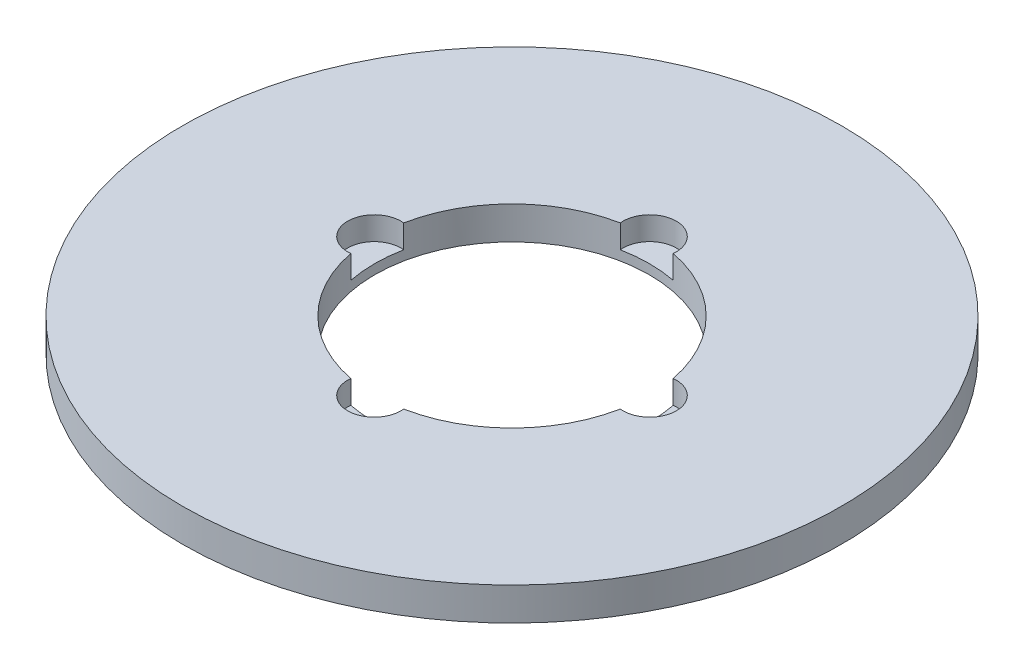
ISO-10303-21;
HEADER;
FILE_DESCRIPTION(('STEP AP214'),'2;1');
FILE_NAME('part.step','',(''),(''),'','','');
FILE_SCHEMA(('AUTOMOTIVE_DESIGN { 1 0 10303 214 1 1 1 1 }'));
ENDSEC;
DATA;
#1=APPLICATION_CONTEXT('core data for automotive mechanical design processes');
#2=APPLICATION_PROTOCOL_DEFINITION('international standard','automotive_design',2000,#1);
#3=PRODUCT_CONTEXT('',#1,'mechanical');
#4=PRODUCT('Part','Part','',(#3));
#5=PRODUCT_RELATED_PRODUCT_CATEGORY('part','',(#4));
#6=PRODUCT_DEFINITION_FORMATION('','',#4);
#7=PRODUCT_DEFINITION_CONTEXT('part definition',#1,'design');
#8=PRODUCT_DEFINITION('design','',#6,#7);
#9=PRODUCT_DEFINITION_SHAPE('','',#8);
#10=(LENGTH_UNIT() NAMED_UNIT(*) SI_UNIT(.MILLI.,.METRE.));
#11=(NAMED_UNIT(*) PLANE_ANGLE_UNIT() SI_UNIT($,.RADIAN.));
#12=(NAMED_UNIT(*) SI_UNIT($,.STERADIAN.) SOLID_ANGLE_UNIT());
#13=UNCERTAINTY_MEASURE_WITH_UNIT(LENGTH_MEASURE(1.E-05),#10,'distance_accuracy_value','');
#14=(GEOMETRIC_REPRESENTATION_CONTEXT(3) GLOBAL_UNCERTAINTY_ASSIGNED_CONTEXT((#13)) GLOBAL_UNIT_ASSIGNED_CONTEXT((#10,
#11,#12)) REPRESENTATION_CONTEXT('',''));
#15=CARTESIAN_POINT('',(0.,0.,0.));
#16=DIRECTION('',(0.,0.,1.));
#17=DIRECTION('',(1.,0.,0.));
#18=AXIS2_PLACEMENT_3D('',#15,#16,#17);
#19=CARTESIAN_POINT('',(0.,9.,0.));
#20=DIRECTION('',(0.,-1.,0.));
#21=DIRECTION('',(0.,0.,-1.));
#22=AXIS2_PLACEMENT_3D('',#19,#20,#21);
#23=CYLINDRICAL_SURFACE('',#22,90.);
#24=CARTESIAN_POINT('',(0.,9.,0.));
#25=DIRECTION('',(0.,1.,0.));
#26=DIRECTION('',(0.,0.,1.));
#27=AXIS2_PLACEMENT_3D('',#24,#25,#26);
#28=CIRCLE('',#27,90.);
#29=CARTESIAN_POINT('',(0.,9.,90.));
#30=VERTEX_POINT('',#29);
#31=EDGE_CURVE('E145',#30,#30,#28,.T.);
#32=ORIENTED_EDGE('',*,*,#31,.F.);
#33=EDGE_LOOP('',(#32));
#34=FACE_BOUND('',#33,.T.);
#35=CARTESIAN_POINT('',(0.,0.,0.));
#36=DIRECTION('',(0.,1.,0.));
#37=DIRECTION('',(0.,0.,1.));
#38=AXIS2_PLACEMENT_3D('',#35,#36,#37);
#39=CIRCLE('',#38,90.);
#40=CARTESIAN_POINT('',(0.,0.,90.));
#41=VERTEX_POINT('',#40);
#42=EDGE_CURVE('E143',#41,#41,#39,.T.);
#43=ORIENTED_EDGE('',*,*,#42,.T.);
#44=EDGE_LOOP('',(#43));
#45=FACE_BOUND('',#44,.T.);
#46=ADVANCED_FACE('F39',(#34,#45),#23,.T.);
#47=CARTESIAN_POINT('',(0.,9.,0.));
#48=DIRECTION('',(0.,1.,0.));
#49=DIRECTION('',(0.,0.,1.));
#50=AXIS2_PLACEMENT_3D('',#47,#48,#49);
#51=PLANE('',#50);
#52=CARTESIAN_POINT('',(1.3128581398508E-13,9.,37.6017515902234));
#53=DIRECTION('',(0.,1.,0.));
#54=DIRECTION('',(1.,0.,0.));
#55=AXIS2_PLACEMENT_3D('',#52,#53,#54);
#56=CIRCLE('',#55,7.27109568283892);
#57=CARTESIAN_POINT('',(-7.22643843125415,9.,36.797127436789));
#58=VERTEX_POINT('',#57);
#59=CARTESIAN_POINT('',(7.22643843125441,9.,36.797127436789));
#60=VERTEX_POINT('',#59);
#61=EDGE_CURVE('E152',#58,#60,#56,.T.);
#62=ORIENTED_EDGE('',*,*,#61,.F.);
#63=CARTESIAN_POINT('',(0.,9.,0.));
#64=DIRECTION('',(0.,1.,0.));
#65=DIRECTION('',(0.,0.,1.));
#66=AXIS2_PLACEMENT_3D('',#63,#64,#65);
#67=CIRCLE('',#66,37.5);
#68=CARTESIAN_POINT('',(-36.797127436789,9.,7.22643843125428));
#69=VERTEX_POINT('',#68);
#70=EDGE_CURVE('E133',#69,#58,#67,.T.);
#71=ORIENTED_EDGE('',*,*,#70,.F.);
#72=CARTESIAN_POINT('',(-37.6017515902234,9.,0.));
#73=DIRECTION('',(0.,1.,0.));
#74=DIRECTION('',(0.,0.,1.));
#75=AXIS2_PLACEMENT_3D('',#72,#73,#74);
#76=CIRCLE('',#75,7.27109568283892);
#77=CARTESIAN_POINT('',(-36.797127436789,9.,-7.22643843125428));
#78=VERTEX_POINT('',#77);
#79=EDGE_CURVE('E128',#78,#69,#76,.T.);
#80=ORIENTED_EDGE('',*,*,#79,.F.);
#81=CARTESIAN_POINT('',(-7.22643843125466,9.,-36.7971274367889));
#82=VERTEX_POINT('',#81);
#83=EDGE_CURVE('E121',#82,#78,#67,.T.);
#84=ORIENTED_EDGE('',*,*,#83,.F.);
#85=CARTESIAN_POINT('',(-3.93857441955241E-13,9.,-37.6017515902234));
#86=DIRECTION('',(0.,1.,0.));
#87=DIRECTION('',(-1.,0.,0.));
#88=AXIS2_PLACEMENT_3D('',#85,#86,#87);
#89=CIRCLE('',#88,7.27109568283892);
#90=CARTESIAN_POINT('',(7.22643843125389,9.,-36.7971274367891));
#91=VERTEX_POINT('',#90);
#92=EDGE_CURVE('E105',#91,#82,#89,.T.);
#93=ORIENTED_EDGE('',*,*,#92,.F.);
#94=CARTESIAN_POINT('',(36.797127436789,9.,-7.22643843125428));
#95=VERTEX_POINT('',#94);
#96=EDGE_CURVE('E131',#95,#91,#67,.T.);
#97=ORIENTED_EDGE('',*,*,#96,.F.);
#98=CARTESIAN_POINT('',(37.6017515902234,9.,0.));
#99=DIRECTION('',(0.,1.,0.));
#100=DIRECTION('',(0.,0.,-1.));
#101=AXIS2_PLACEMENT_3D('',#98,#99,#100);
#102=CIRCLE('',#101,7.27109568283892);
#103=CARTESIAN_POINT('',(36.797127436789,9.,7.22643843125428));
#104=VERTEX_POINT('',#103);
#105=EDGE_CURVE('E154',#104,#95,#102,.T.);
#106=ORIENTED_EDGE('',*,*,#105,.F.);
#107=EDGE_CURVE('E134',#60,#104,#67,.T.);
#108=ORIENTED_EDGE('',*,*,#107,.F.);
#109=EDGE_LOOP('',(#62,#71,#80,#84,#93,#97,#106,#108));
#110=FACE_BOUND('',#109,.T.);
#111=ORIENTED_EDGE('',*,*,#31,.T.);
#112=EDGE_LOOP('',(#111));
#113=FACE_BOUND('',#112,.T.);
#114=ADVANCED_FACE('F130',(#110,#113),#51,.T.);
#115=CARTESIAN_POINT('',(0.,0.,0.));
#116=DIRECTION('',(0.,1.,0.));
#117=DIRECTION('',(0.,0.,1.));
#118=AXIS2_PLACEMENT_3D('',#115,#116,#117);
#119=PLANE('',#118);
#120=CARTESIAN_POINT('',(0.,0.,0.));
#121=DIRECTION('',(0.,1.,0.));
#122=DIRECTION('',(0.,0.,1.));
#123=AXIS2_PLACEMENT_3D('',#120,#121,#122);
#124=CIRCLE('',#123,37.5);
#125=CARTESIAN_POINT('',(0.,0.,37.5));
#126=VERTEX_POINT('',#125);
#127=EDGE_CURVE('E135',#126,#126,#124,.T.);
#128=ORIENTED_EDGE('',*,*,#127,.T.);
#129=EDGE_LOOP('',(#128));
#130=FACE_BOUND('',#129,.T.);
#131=ORIENTED_EDGE('',*,*,#42,.F.);
#132=EDGE_LOOP('',(#131));
#133=FACE_BOUND('',#132,.T.);
#134=ADVANCED_FACE('F195',(#130,#133),#119,.F.);
#135=CARTESIAN_POINT('',(0.,9.,0.));
#136=DIRECTION('',(0.,-1.,0.));
#137=DIRECTION('',(0.,0.,-1.));
#138=AXIS2_PLACEMENT_3D('',#135,#136,#137);
#139=CYLINDRICAL_SURFACE('',#138,37.5);
#140=DIRECTION('',(0.,1.,0.));
#141=VECTOR('',#140,1.);
#142=CARTESIAN_POINT('',(-7.22643843125415,5.82186332209537,36.797127436789));
#143=LINE('',#142,#141);
#144=CARTESIAN_POINT('',(-7.22643843125415,2.64372664419074,36.797127436789));
#145=VERTEX_POINT('',#144);
#146=EDGE_CURVE('E11',#145,#58,#143,.T.);
#147=ORIENTED_EDGE('',*,*,#146,.F.);
#148=CARTESIAN_POINT('',(0.,2.64372664419074,0.));
#149=DIRECTION('',(0.,1.,0.));
#150=DIRECTION('',(0.,0.,1.));
#151=AXIS2_PLACEMENT_3D('',#148,#149,#150);
#152=CIRCLE('',#151,37.5);
#153=CARTESIAN_POINT('',(7.22643843125441,2.64372664419074,36.797127436789));
#154=VERTEX_POINT('',#153);
#155=EDGE_CURVE('E169',#145,#154,#152,.T.);
#156=ORIENTED_EDGE('',*,*,#155,.T.);
#157=DIRECTION('',(0.,1.,0.));
#158=VECTOR('',#157,1.);
#159=CARTESIAN_POINT('',(7.22643843125441,5.82186332209537,36.797127436789));
#160=LINE('',#159,#158);
#161=EDGE_CURVE('E46',#60,#154,#160,.F.);
#162=ORIENTED_EDGE('',*,*,#161,.F.);
#163=ORIENTED_EDGE('',*,*,#107,.T.);
#164=DIRECTION('',(0.,1.,0.));
#165=VECTOR('',#164,1.);
#166=CARTESIAN_POINT('',(36.797127436789,5.82186332209537,7.22643843125428));
#167=LINE('',#166,#165);
#168=CARTESIAN_POINT('',(36.797127436789,2.64372664419074,7.22643843125428));
#169=VERTEX_POINT('',#168);
#170=EDGE_CURVE('E151',#169,#104,#167,.T.);
#171=ORIENTED_EDGE('',*,*,#170,.F.);
#172=CARTESIAN_POINT('',(0.,2.64372664419074,0.));
#173=DIRECTION('',(0.,1.,0.));
#174=DIRECTION('',(0.,0.,1.));
#175=AXIS2_PLACEMENT_3D('',#172,#173,#174);
#176=CIRCLE('',#175,37.5);
#177=CARTESIAN_POINT('',(36.797127436789,2.64372664419074,-7.22643843125428));
#178=VERTEX_POINT('',#177);
#179=EDGE_CURVE('E173',#169,#178,#176,.T.);
#180=ORIENTED_EDGE('',*,*,#179,.T.);
#181=DIRECTION('',(0.,1.,0.));
#182=VECTOR('',#181,1.);
#183=CARTESIAN_POINT('',(36.797127436789,5.82186332209537,-7.22643843125428));
#184=LINE('',#183,#182);
#185=EDGE_CURVE('E168',#95,#178,#184,.F.);
#186=ORIENTED_EDGE('',*,*,#185,.F.);
#187=ORIENTED_EDGE('',*,*,#96,.T.);
#188=DIRECTION('',(0.,1.,0.));
#189=VECTOR('',#188,1.);
#190=CARTESIAN_POINT('',(7.22643843125389,5.82186332209537,-36.7971274367891));
#191=LINE('',#190,#189);
#192=CARTESIAN_POINT('',(7.22643843125389,2.64372664419074,-36.7971274367891));
#193=VERTEX_POINT('',#192);
#194=EDGE_CURVE('E108',#193,#91,#191,.T.);
#195=ORIENTED_EDGE('',*,*,#194,.F.);
#196=CARTESIAN_POINT('',(0.,2.64372664419074,0.));
#197=DIRECTION('',(0.,1.,0.));
#198=DIRECTION('',(0.,0.,1.));
#199=AXIS2_PLACEMENT_3D('',#196,#197,#198);
#200=CIRCLE('',#199,37.5);
#201=CARTESIAN_POINT('',(-7.22643843125466,2.64372664419074,-36.7971274367889));
#202=VERTEX_POINT('',#201);
#203=EDGE_CURVE('E122',#193,#202,#200,.T.);
#204=ORIENTED_EDGE('',*,*,#203,.T.);
#205=DIRECTION('',(0.,1.,0.));
#206=VECTOR('',#205,1.);
#207=CARTESIAN_POINT('',(-7.22643843125466,5.82186332209537,-36.7971274367889));
#208=LINE('',#207,#206);
#209=EDGE_CURVE('E106',#82,#202,#208,.F.);
#210=ORIENTED_EDGE('',*,*,#209,.F.);
#211=ORIENTED_EDGE('',*,*,#83,.T.);
#212=DIRECTION('',(0.,1.,0.));
#213=VECTOR('',#212,1.);
#214=CARTESIAN_POINT('',(-36.797127436789,5.82186332209537,-7.22643843125428));
#215=LINE('',#214,#213);
#216=CARTESIAN_POINT('',(-36.797127436789,2.64372664419074,-7.22643843125428));
#217=VERTEX_POINT('',#216);
#218=EDGE_CURVE('E177',#217,#78,#215,.T.);
#219=ORIENTED_EDGE('',*,*,#218,.F.);
#220=CARTESIAN_POINT('',(0.,2.64372664419074,0.));
#221=DIRECTION('',(0.,1.,0.));
#222=DIRECTION('',(0.,0.,1.));
#223=AXIS2_PLACEMENT_3D('',#220,#221,#222);
#224=CIRCLE('',#223,37.5);
#225=CARTESIAN_POINT('',(-36.797127436789,2.64372664419074,7.22643843125428));
#226=VERTEX_POINT('',#225);
#227=EDGE_CURVE('E185',#217,#226,#224,.T.);
#228=ORIENTED_EDGE('',*,*,#227,.T.);
#229=DIRECTION('',(0.,1.,0.));
#230=VECTOR('',#229,1.);
#231=CARTESIAN_POINT('',(-36.797127436789,5.82186332209537,7.22643843125428));
#232=LINE('',#231,#230);
#233=EDGE_CURVE('E179',#69,#226,#232,.F.);
#234=ORIENTED_EDGE('',*,*,#233,.F.);
#235=ORIENTED_EDGE('',*,*,#70,.T.);
#236=EDGE_LOOP('',(#147,#156,#162,#163,#171,#180,#186,#187,#195,#204,#210,#211,#219,#228,#234,#235));
#237=FACE_BOUND('',#236,.T.);
#238=ORIENTED_EDGE('',*,*,#127,.F.);
#239=EDGE_LOOP('',(#238));
#240=FACE_BOUND('',#239,.T.);
#241=ADVANCED_FACE('F117',(#237,#240),#139,.F.);
#242=CARTESIAN_POINT('',(-37.6017515902234,2.64372664419074,0.));
#243=DIRECTION('',(0.,1.,0.));
#244=DIRECTION('',(0.,0.,1.));
#245=AXIS2_PLACEMENT_3D('',#242,#243,#244);
#246=CYLINDRICAL_SURFACE('',#245,7.27109568283892);
#247=ORIENTED_EDGE('',*,*,#218,.T.);
#248=ORIENTED_EDGE('',*,*,#79,.T.);
#249=ORIENTED_EDGE('',*,*,#233,.T.);
#250=CARTESIAN_POINT('',(-37.6017515902234,2.64372664419074,0.));
#251=DIRECTION('',(0.,1.,0.));
#252=DIRECTION('',(0.,0.,1.));
#253=AXIS2_PLACEMENT_3D('',#250,#251,#252);
#254=CIRCLE('',#253,7.27109568283892);
#255=EDGE_CURVE('E140',#217,#226,#254,.T.);
#256=ORIENTED_EDGE('',*,*,#255,.F.);
#257=EDGE_LOOP('',(#247,#248,#249,#256));
#258=FACE_BOUND('',#257,.T.);
#259=ADVANCED_FACE('F200',(#258),#246,.F.);
#260=CARTESIAN_POINT('',(-37.6017515902234,2.64372664419074,0.));
#261=DIRECTION('',(0.,1.,0.));
#262=DIRECTION('',(0.,0.,1.));
#263=AXIS2_PLACEMENT_3D('',#260,#261,#262);
#264=PLANE('',#263);
#265=ORIENTED_EDGE('',*,*,#255,.T.);
#266=ORIENTED_EDGE('',*,*,#227,.F.);
#267=EDGE_LOOP('',(#265,#266));
#268=FACE_BOUND('',#267,.T.);
#269=ADVANCED_FACE('F202',(#268),#264,.T.);
#270=CARTESIAN_POINT('',(-3.93857441955241E-13,2.64372664419074,-37.6017515902234));
#271=DIRECTION('',(0.,1.,0.));
#272=DIRECTION('',(0.,0.,1.));
#273=AXIS2_PLACEMENT_3D('',#270,#271,#272);
#274=CYLINDRICAL_SURFACE('',#273,7.27109568283892);
#275=ORIENTED_EDGE('',*,*,#194,.T.);
#276=ORIENTED_EDGE('',*,*,#92,.T.);
#277=ORIENTED_EDGE('',*,*,#209,.T.);
#278=CARTESIAN_POINT('',(-3.93857441955241E-13,2.64372664419074,-37.6017515902234));
#279=DIRECTION('',(0.,1.,0.));
#280=DIRECTION('',(-1.,0.,0.));
#281=AXIS2_PLACEMENT_3D('',#278,#279,#280);
#282=CIRCLE('',#281,7.27109568283892);
#283=EDGE_CURVE('E111',#193,#202,#282,.T.);
#284=ORIENTED_EDGE('',*,*,#283,.F.);
#285=EDGE_LOOP('',(#275,#276,#277,#284));
#286=FACE_BOUND('',#285,.T.);
#287=ADVANCED_FACE('F102',(#286),#274,.F.);
#288=CARTESIAN_POINT('',(-3.93857441955241E-13,2.64372664419074,-37.6017515902234));
#289=DIRECTION('',(0.,1.,0.));
#290=DIRECTION('',(-1.,0.,0.));
#291=AXIS2_PLACEMENT_3D('',#288,#289,#290);
#292=PLANE('',#291);
#293=ORIENTED_EDGE('',*,*,#283,.T.);
#294=ORIENTED_EDGE('',*,*,#203,.F.);
#295=EDGE_LOOP('',(#293,#294));
#296=FACE_BOUND('',#295,.T.);
#297=ADVANCED_FACE('F211',(#296),#292,.T.);
#298=CARTESIAN_POINT('',(37.6017515902234,2.64372664419074,0.));
#299=DIRECTION('',(0.,1.,0.));
#300=DIRECTION('',(0.,0.,1.));
#301=AXIS2_PLACEMENT_3D('',#298,#299,#300);
#302=CYLINDRICAL_SURFACE('',#301,7.27109568283892);
#303=ORIENTED_EDGE('',*,*,#170,.T.);
#304=ORIENTED_EDGE('',*,*,#105,.T.);
#305=ORIENTED_EDGE('',*,*,#185,.T.);
#306=CARTESIAN_POINT('',(37.6017515902234,2.64372664419074,0.));
#307=DIRECTION('',(0.,1.,0.));
#308=DIRECTION('',(0.,0.,-1.));
#309=AXIS2_PLACEMENT_3D('',#306,#307,#308);
#310=CIRCLE('',#309,7.27109568283892);
#311=EDGE_CURVE('E56',#169,#178,#310,.T.);
#312=ORIENTED_EDGE('',*,*,#311,.F.);
#313=EDGE_LOOP('',(#303,#304,#305,#312));
#314=FACE_BOUND('',#313,.T.);
#315=ADVANCED_FACE('F212',(#314),#302,.F.);
#316=CARTESIAN_POINT('',(37.6017515902234,2.64372664419074,0.));
#317=DIRECTION('',(0.,1.,0.));
#318=DIRECTION('',(0.,0.,-1.));
#319=AXIS2_PLACEMENT_3D('',#316,#317,#318);
#320=PLANE('',#319);
#321=ORIENTED_EDGE('',*,*,#311,.T.);
#322=ORIENTED_EDGE('',*,*,#179,.F.);
#323=EDGE_LOOP('',(#321,#322));
#324=FACE_BOUND('',#323,.T.);
#325=ADVANCED_FACE('F217',(#324),#320,.T.);
#326=CARTESIAN_POINT('',(1.3128581398508E-13,2.64372664419074,37.6017515902234));
#327=DIRECTION('',(0.,1.,0.));
#328=DIRECTION('',(0.,0.,1.));
#329=AXIS2_PLACEMENT_3D('',#326,#327,#328);
#330=CYLINDRICAL_SURFACE('',#329,7.27109568283892);
#331=ORIENTED_EDGE('',*,*,#146,.T.);
#332=ORIENTED_EDGE('',*,*,#61,.T.);
#333=ORIENTED_EDGE('',*,*,#161,.T.);
#334=CARTESIAN_POINT('',(1.3128581398508E-13,2.64372664419074,37.6017515902234));
#335=DIRECTION('',(0.,1.,0.));
#336=DIRECTION('',(1.,0.,0.));
#337=AXIS2_PLACEMENT_3D('',#334,#335,#336);
#338=CIRCLE('',#337,7.27109568283892);
#339=EDGE_CURVE('E55',#145,#154,#338,.T.);
#340=ORIENTED_EDGE('',*,*,#339,.F.);
#341=EDGE_LOOP('',(#331,#332,#333,#340));
#342=FACE_BOUND('',#341,.T.);
#343=ADVANCED_FACE('F170',(#342),#330,.F.);
#344=CARTESIAN_POINT('',(1.3128581398508E-13,2.64372664419074,37.6017515902234));
#345=DIRECTION('',(0.,1.,0.));
#346=DIRECTION('',(1.,0.,0.));
#347=AXIS2_PLACEMENT_3D('',#344,#345,#346);
#348=PLANE('',#347);
#349=ORIENTED_EDGE('',*,*,#339,.T.);
#350=ORIENTED_EDGE('',*,*,#155,.F.);
#351=EDGE_LOOP('',(#349,#350));
#352=FACE_BOUND('',#351,.T.);
#353=ADVANCED_FACE('F224',(#352),#348,.T.);
#354=CLOSED_SHELL('',(#46,#114,#134,#241,#259,#269,#287,#297,#315,#325,#343,#353));
#355=MANIFOLD_SOLID_BREP('B2',#354);
#356=ADVANCED_BREP_SHAPE_REPRESENTATION('',(#18,#355),#14);
#357=SHAPE_DEFINITION_REPRESENTATION(#9,#356);
ENDSEC;
END-ISO-10303-21;
